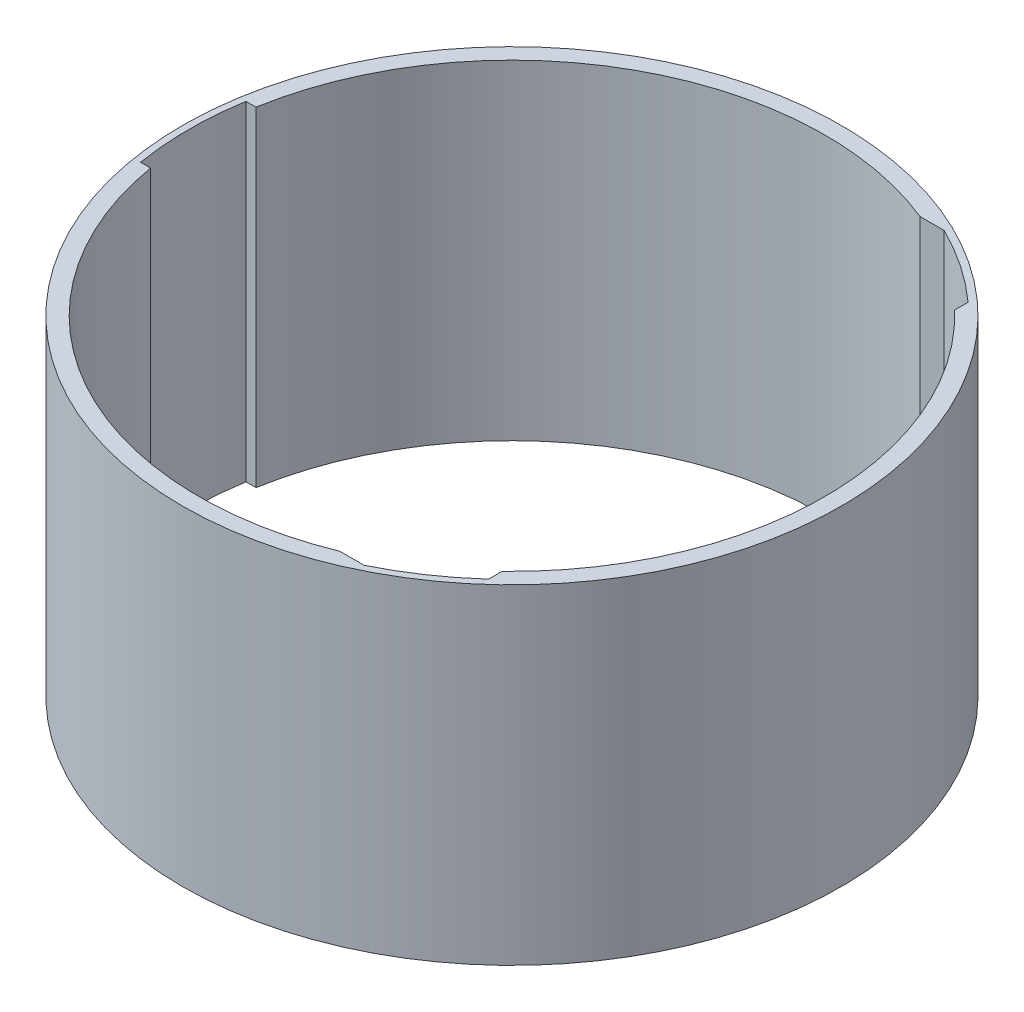
ISO-10303-21;
HEADER;
FILE_DESCRIPTION(('STEP AP214'),'2;1');
FILE_NAME('part.step','',(''),(''),'','','');
FILE_SCHEMA(('AUTOMOTIVE_DESIGN { 1 0 10303 214 1 1 1 1 }'));
ENDSEC;
DATA;
#1=APPLICATION_CONTEXT('core data for automotive mechanical design processes');
#2=APPLICATION_PROTOCOL_DEFINITION('international standard','automotive_design',2000,#1);
#3=PRODUCT_CONTEXT('',#1,'mechanical');
#4=PRODUCT('Part','Part','',(#3));
#5=PRODUCT_RELATED_PRODUCT_CATEGORY('part','',(#4));
#6=PRODUCT_DEFINITION_FORMATION('','',#4);
#7=PRODUCT_DEFINITION_CONTEXT('part definition',#1,'design');
#8=PRODUCT_DEFINITION('design','',#6,#7);
#9=PRODUCT_DEFINITION_SHAPE('','',#8);
#10=(LENGTH_UNIT() NAMED_UNIT(*) SI_UNIT(.MILLI.,.METRE.));
#11=(NAMED_UNIT(*) PLANE_ANGLE_UNIT() SI_UNIT($,.RADIAN.));
#12=(NAMED_UNIT(*) SI_UNIT($,.STERADIAN.) SOLID_ANGLE_UNIT());
#13=UNCERTAINTY_MEASURE_WITH_UNIT(LENGTH_MEASURE(1.E-05),#10,'distance_accuracy_value','');
#14=(GEOMETRIC_REPRESENTATION_CONTEXT(3) GLOBAL_UNCERTAINTY_ASSIGNED_CONTEXT((#13)) GLOBAL_UNIT_ASSIGNED_CONTEXT((#10,
#11,#12)) REPRESENTATION_CONTEXT('',''));
#15=CARTESIAN_POINT('',(0.,0.,0.));
#16=DIRECTION('',(0.,0.,1.));
#17=DIRECTION('',(1.,0.,0.));
#18=AXIS2_PLACEMENT_3D('',#15,#16,#17);
#19=CARTESIAN_POINT('',(0.,100.,0.));
#20=DIRECTION('',(0.,1.,0.));
#21=DIRECTION('',(0.,0.,1.));
#22=AXIS2_PLACEMENT_3D('',#19,#20,#21);
#23=PLANE('',#22);
#24=DIRECTION('',(0.,0.,-1.00000000000002));
#25=VECTOR('',#24,1.);
#26=CARTESIAN_POINT('',(65.656830535391,100.,0.));
#27=LINE('',#26,#25);
#28=CARTESIAN_POINT('',(65.6568305353912,100.,-68.6598907954808));
#29=VERTEX_POINT('',#28);
#30=CARTESIAN_POINT('',(65.6568305353908,100.,-72.7542480137574));
#31=VERTEX_POINT('',#30);
#32=EDGE_CURVE('E134',#29,#31,#27,.T.);
#33=ORIENTED_EDGE('',*,*,#32,.F.);
#34=CARTESIAN_POINT('',(0.,100.,0.));
#35=DIRECTION('',(0.,1.,0.));
#36=DIRECTION('',(0.,0.,1.));
#37=AXIS2_PLACEMENT_3D('',#34,#35,#36);
#38=CIRCLE('',#37,95.);
#39=CARTESIAN_POINT('',(65.6568305353945,100.,68.6598907954745));
#40=VERTEX_POINT('',#39);
#41=EDGE_CURVE('E219',#40,#29,#38,.T.);
#42=ORIENTED_EDGE('',*,*,#41,.F.);
#43=DIRECTION('',(0.,0.,1.00000000000004));
#44=VECTOR('',#43,1.);
#45=CARTESIAN_POINT('',(65.6568305353921,100.,0.));
#46=LINE('',#45,#44);
#47=CARTESIAN_POINT('',(65.6568305353932,100.,72.7542480137596));
#48=VERTEX_POINT('',#47);
#49=EDGE_CURVE('E171',#40,#48,#46,.T.);
#50=ORIENTED_EDGE('',*,*,#49,.T.);
#51=CARTESIAN_POINT('',(0.,100.,0.));
#52=DIRECTION('',(0.,1.,0.));
#53=DIRECTION('',(0.,0.,1.00000000000004));
#54=AXIS2_PLACEMENT_3D('',#51,#52,#53);
#55=CIRCLE('',#54,98.);
#56=CARTESIAN_POINT('',(43.1540945167013,100.,87.9870679500372));
#57=VERTEX_POINT('',#56);
#58=EDGE_CURVE('E180',#57,#48,#55,.T.);
#59=ORIENTED_EDGE('',*,*,#58,.F.);
#60=DIRECTION('',(-1.00000000000004,0.,0.));
#61=VECTOR('',#60,1.);
#62=CARTESIAN_POINT('',(0.,100.,87.987067950037));
#63=LINE('',#62,#61);
#64=CARTESIAN_POINT('',(35.822840110135,100.,87.9870679500373));
#65=VERTEX_POINT('',#64);
#66=EDGE_CURVE('E177',#57,#65,#63,.T.);
#67=ORIENTED_EDGE('',*,*,#66,.T.);
#68=CARTESIAN_POINT('',(-93.6429388688757,100.,16.0000000000002));
#69=VERTEX_POINT('',#68);
#70=EDGE_CURVE('E215',#69,#65,#38,.T.);
#71=ORIENTED_EDGE('',*,*,#70,.F.);
#72=DIRECTION('',(1.,0.,0.));
#73=VECTOR('',#72,1.);
#74=CARTESIAN_POINT('',(0.,100.,16.0000000000001));
#75=LINE('',#74,#73);
#76=CARTESIAN_POINT('',(-96.6850557221749,100.,16.0000000000001));
#77=VERTEX_POINT('',#76);
#78=EDGE_CURVE('E54',#77,#69,#75,.T.);
#79=ORIENTED_EDGE('',*,*,#78,.F.);
#80=CARTESIAN_POINT('',(0.,100.,0.));
#81=DIRECTION('',(0.,1.,0.));
#82=DIRECTION('',(0.,0.,1.));
#83=AXIS2_PLACEMENT_3D('',#80,#81,#82);
#84=CIRCLE('',#83,98.);
#85=CARTESIAN_POINT('',(-96.6850557221749,100.,-16.));
#86=VERTEX_POINT('',#85);
#87=EDGE_CURVE('E205',#86,#77,#84,.T.);
#88=ORIENTED_EDGE('',*,*,#87,.F.);
#89=DIRECTION('',(1.,0.,0.));
#90=VECTOR('',#89,1.);
#91=CARTESIAN_POINT('',(0.,100.,-16.0000000000001));
#92=LINE('',#91,#90);
#93=CARTESIAN_POINT('',(-93.6429388688762,100.,-16.));
#94=VERTEX_POINT('',#93);
#95=EDGE_CURVE('E202',#86,#94,#92,.T.);
#96=ORIENTED_EDGE('',*,*,#95,.T.);
#97=CARTESIAN_POINT('',(35.8228401101249,100.,-87.987067950037));
#98=VERTEX_POINT('',#97);
#99=EDGE_CURVE('E218',#98,#94,#38,.T.);
#100=ORIENTED_EDGE('',*,*,#99,.F.);
#101=DIRECTION('',(-1.00000000000002,0.,0.));
#102=VECTOR('',#101,1.);
#103=CARTESIAN_POINT('',(0.,100.,-87.9870679500354));
#104=LINE('',#103,#102);
#105=CARTESIAN_POINT('',(43.1540945166999,100.,-87.9870679500354));
#106=VERTEX_POINT('',#105);
#107=EDGE_CURVE('E62',#106,#98,#104,.T.);
#108=ORIENTED_EDGE('',*,*,#107,.F.);
#109=CARTESIAN_POINT('',(0.,100.,0.));
#110=DIRECTION('',(0.,1.,0.));
#111=DIRECTION('',(0.,0.,1.00000000000002));
#112=AXIS2_PLACEMENT_3D('',#109,#110,#111);
#113=CIRCLE('',#112,98.);
#114=EDGE_CURVE('E155',#31,#106,#113,.T.);
#115=ORIENTED_EDGE('',*,*,#114,.F.);
#116=EDGE_LOOP('',(#33,#42,#50,#59,#67,#71,#79,#88,#96,#100,#108,#115));
#117=FACE_BOUND('',#116,.T.);
#118=CARTESIAN_POINT('',(0.,100.,0.));
#119=DIRECTION('',(0.,1.,0.));
#120=DIRECTION('',(0.,0.,1.));
#121=AXIS2_PLACEMENT_3D('',#118,#119,#120);
#122=CIRCLE('',#121,100.);
#123=CARTESIAN_POINT('',(0.,100.,100.));
#124=VERTEX_POINT('',#123);
#125=EDGE_CURVE('E11',#124,#124,#122,.T.);
#126=ORIENTED_EDGE('',*,*,#125,.T.);
#127=EDGE_LOOP('',(#126));
#128=FACE_BOUND('',#127,.T.);
#129=ADVANCED_FACE('F39',(#117,#128),#23,.T.);
#130=CARTESIAN_POINT('',(0.,0.,0.));
#131=DIRECTION('',(0.,1.,0.));
#132=DIRECTION('',(0.,0.,1.));
#133=AXIS2_PLACEMENT_3D('',#130,#131,#132);
#134=PLANE('',#133);
#135=CARTESIAN_POINT('',(0.,0.,0.));
#136=DIRECTION('',(0.,1.,0.));
#137=DIRECTION('',(0.,0.,1.));
#138=AXIS2_PLACEMENT_3D('',#135,#136,#137);
#139=CIRCLE('',#138,95.);
#140=CARTESIAN_POINT('',(65.6568305353929,0.,68.6598907954818));
#141=VERTEX_POINT('',#140);
#142=CARTESIAN_POINT('',(65.6568305353912,0.,-68.6598907954808));
#143=VERTEX_POINT('',#142);
#144=EDGE_CURVE('E153',#141,#143,#139,.T.);
#145=ORIENTED_EDGE('',*,*,#144,.T.);
#146=DIRECTION('',(0.,0.,-1.00000000000002));
#147=VECTOR('',#146,1.);
#148=CARTESIAN_POINT('',(65.656830535391,0.,0.));
#149=LINE('',#148,#147);
#150=CARTESIAN_POINT('',(65.6568305353908,0.,-72.7542480137574));
#151=VERTEX_POINT('',#150);
#152=EDGE_CURVE('E131',#143,#151,#149,.T.);
#153=ORIENTED_EDGE('',*,*,#152,.T.);
#154=CARTESIAN_POINT('',(0.,0.,0.));
#155=DIRECTION('',(0.,1.,0.));
#156=DIRECTION('',(0.,0.,1.00000000000002));
#157=AXIS2_PLACEMENT_3D('',#154,#155,#156);
#158=CIRCLE('',#157,98.);
#159=CARTESIAN_POINT('',(43.1540945166999,0.,-87.9870679500354));
#160=VERTEX_POINT('',#159);
#161=EDGE_CURVE('E142',#151,#160,#158,.T.);
#162=ORIENTED_EDGE('',*,*,#161,.T.);
#163=DIRECTION('',(-1.00000000000002,0.,0.));
#164=VECTOR('',#163,1.);
#165=CARTESIAN_POINT('',(0.,0.,-87.9870679500354));
#166=LINE('',#165,#164);
#167=CARTESIAN_POINT('',(35.8228401101346,0.,-87.9870679500354));
#168=VERTEX_POINT('',#167);
#169=EDGE_CURVE('E139',#160,#168,#166,.T.);
#170=ORIENTED_EDGE('',*,*,#169,.T.);
#171=CARTESIAN_POINT('',(-93.6429388688762,0.,-16.));
#172=VERTEX_POINT('',#171);
#173=EDGE_CURVE('E221',#168,#172,#139,.T.);
#174=ORIENTED_EDGE('',*,*,#173,.T.);
#175=DIRECTION('',(1.,0.,0.));
#176=VECTOR('',#175,1.);
#177=CARTESIAN_POINT('',(0.,0.,-16.0000000000001));
#178=LINE('',#177,#176);
#179=CARTESIAN_POINT('',(-96.6850557221749,0.,-16.));
#180=VERTEX_POINT('',#179);
#181=EDGE_CURVE('E193',#180,#172,#178,.T.);
#182=ORIENTED_EDGE('',*,*,#181,.F.);
#183=CARTESIAN_POINT('',(0.,0.,0.));
#184=DIRECTION('',(0.,1.,0.));
#185=DIRECTION('',(0.,0.,1.));
#186=AXIS2_PLACEMENT_3D('',#183,#184,#185);
#187=CIRCLE('',#186,98.);
#188=CARTESIAN_POINT('',(-96.6850557221749,0.,16.0000000000001));
#189=VERTEX_POINT('',#188);
#190=EDGE_CURVE('E195',#180,#189,#187,.T.);
#191=ORIENTED_EDGE('',*,*,#190,.T.);
#192=DIRECTION('',(1.,0.,0.));
#193=VECTOR('',#192,1.);
#194=CARTESIAN_POINT('',(0.,0.,16.0000000000001));
#195=LINE('',#194,#193);
#196=CARTESIAN_POINT('',(-93.6429388688763,0.,16.0000000000001));
#197=VERTEX_POINT('',#196);
#198=EDGE_CURVE('E198',#189,#197,#195,.T.);
#199=ORIENTED_EDGE('',*,*,#198,.T.);
#200=CARTESIAN_POINT('',(35.822840110135,0.,87.9870679500373));
#201=VERTEX_POINT('',#200);
#202=EDGE_CURVE('E164',#197,#201,#139,.T.);
#203=ORIENTED_EDGE('',*,*,#202,.T.);
#204=DIRECTION('',(-1.00000000000004,0.,0.));
#205=VECTOR('',#204,1.);
#206=CARTESIAN_POINT('',(0.,0.,87.987067950037));
#207=LINE('',#206,#205);
#208=CARTESIAN_POINT('',(43.1540945167013,0.,87.9870679500372));
#209=VERTEX_POINT('',#208);
#210=EDGE_CURVE('E168',#209,#201,#207,.T.);
#211=ORIENTED_EDGE('',*,*,#210,.F.);
#212=CARTESIAN_POINT('',(0.,0.,0.));
#213=DIRECTION('',(0.,1.,0.));
#214=DIRECTION('',(0.,0.,1.00000000000004));
#215=AXIS2_PLACEMENT_3D('',#212,#213,#214);
#216=CIRCLE('',#215,98.);
#217=CARTESIAN_POINT('',(65.6568305353932,0.,72.7542480137596));
#218=VERTEX_POINT('',#217);
#219=EDGE_CURVE('E170',#209,#218,#216,.T.);
#220=ORIENTED_EDGE('',*,*,#219,.T.);
#221=DIRECTION('',(0.,0.,1.00000000000004));
#222=VECTOR('',#221,1.);
#223=CARTESIAN_POINT('',(65.6568305353921,0.,0.));
#224=LINE('',#223,#222);
#225=EDGE_CURVE('E174',#141,#218,#224,.T.);
#226=ORIENTED_EDGE('',*,*,#225,.F.);
#227=EDGE_LOOP('',(#145,#153,#162,#170,#174,#182,#191,#199,#203,#211,#220,#226));
#228=FACE_BOUND('',#227,.T.);
#229=CARTESIAN_POINT('',(0.,0.,0.));
#230=DIRECTION('',(0.,1.,0.));
#231=DIRECTION('',(0.,0.,1.));
#232=AXIS2_PLACEMENT_3D('',#229,#230,#231);
#233=CIRCLE('',#232,100.);
#234=CARTESIAN_POINT('',(0.,0.,100.));
#235=VERTEX_POINT('',#234);
#236=EDGE_CURVE('E43',#235,#235,#233,.T.);
#237=ORIENTED_EDGE('',*,*,#236,.F.);
#238=EDGE_LOOP('',(#237));
#239=FACE_BOUND('',#238,.T.);
#240=ADVANCED_FACE('F149',(#228,#239),#134,.F.);
#241=CARTESIAN_POINT('',(0.,100.,0.));
#242=DIRECTION('',(0.,-1.,0.));
#243=DIRECTION('',(0.,0.,-1.));
#244=AXIS2_PLACEMENT_3D('',#241,#242,#243);
#245=CYLINDRICAL_SURFACE('',#244,95.);
#246=DIRECTION('',(0.,1.,0.));
#247=VECTOR('',#246,1.);
#248=CARTESIAN_POINT('',(65.6568305353912,0.,-68.6598907954808));
#249=LINE('',#248,#247);
#250=EDGE_CURVE('E162',#143,#29,#249,.T.);
#251=ORIENTED_EDGE('',*,*,#250,.F.);
#252=ORIENTED_EDGE('',*,*,#144,.F.);
#253=DIRECTION('',(0.,1.,0.));
#254=VECTOR('',#253,1.);
#255=CARTESIAN_POINT('',(65.6568305353929,0.,68.6598907954818));
#256=LINE('',#255,#254);
#257=EDGE_CURVE('E187',#141,#40,#256,.T.);
#258=ORIENTED_EDGE('',*,*,#257,.T.);
#259=ORIENTED_EDGE('',*,*,#41,.T.);
#260=EDGE_LOOP('',(#251,#252,#258,#259));
#261=FACE_BOUND('',#260,.T.);
#262=ADVANCED_FACE('F257',(#261),#245,.F.);
#263=ORIENTED_EDGE('',*,*,#70,.T.);
#264=DIRECTION('',(0.,1.,0.));
#265=VECTOR('',#264,1.);
#266=CARTESIAN_POINT('',(35.822840110135,0.,87.9870679500373));
#267=LINE('',#266,#265);
#268=EDGE_CURVE('E160',#201,#65,#267,.T.);
#269=ORIENTED_EDGE('',*,*,#268,.F.);
#270=ORIENTED_EDGE('',*,*,#202,.F.);
#271=DIRECTION('',(0.,1.,0.));
#272=VECTOR('',#271,1.);
#273=CARTESIAN_POINT('',(-93.6429388688763,0.,16.0000000000001));
#274=LINE('',#273,#272);
#275=EDGE_CURVE('E210',#197,#69,#274,.T.);
#276=ORIENTED_EDGE('',*,*,#275,.T.);
#277=EDGE_LOOP('',(#263,#269,#270,#276));
#278=FACE_BOUND('',#277,.T.);
#279=ADVANCED_FACE('F245',(#278),#245,.F.);
#280=DIRECTION('',(0.,1.,0.));
#281=VECTOR('',#280,1.);
#282=CARTESIAN_POINT('',(35.8228401101346,0.,-87.9870679500354));
#283=LINE('',#282,#281);
#284=EDGE_CURVE('E165',#168,#98,#283,.T.);
#285=ORIENTED_EDGE('',*,*,#284,.T.);
#286=ORIENTED_EDGE('',*,*,#99,.T.);
#287=DIRECTION('',(0.,1.,0.));
#288=VECTOR('',#287,1.);
#289=CARTESIAN_POINT('',(-93.6429388688762,0.,-16.));
#290=LINE('',#289,#288);
#291=EDGE_CURVE('E181',#172,#94,#290,.T.);
#292=ORIENTED_EDGE('',*,*,#291,.F.);
#293=ORIENTED_EDGE('',*,*,#173,.F.);
#294=EDGE_LOOP('',(#285,#286,#292,#293));
#295=FACE_BOUND('',#294,.T.);
#296=ADVANCED_FACE('F229',(#295),#245,.F.);
#297=CARTESIAN_POINT('',(0.,100.,0.));
#298=DIRECTION('',(0.,-1.,0.));
#299=DIRECTION('',(0.,0.,-1.));
#300=AXIS2_PLACEMENT_3D('',#297,#298,#299);
#301=CYLINDRICAL_SURFACE('',#300,100.);
#302=ORIENTED_EDGE('',*,*,#125,.F.);
#303=EDGE_LOOP('',(#302));
#304=FACE_BOUND('',#303,.T.);
#305=ORIENTED_EDGE('',*,*,#236,.T.);
#306=EDGE_LOOP('',(#305));
#307=FACE_BOUND('',#306,.T.);
#308=ADVANCED_FACE('F41',(#304,#307),#301,.T.);
#309=CARTESIAN_POINT('',(0.,0.,-16.0000000000001));
#310=DIRECTION('',(0.,0.,1.));
#311=DIRECTION('',(1.,0.,0.));
#312=AXIS2_PLACEMENT_3D('',#309,#310,#311);
#313=PLANE('',#312);
#314=ORIENTED_EDGE('',*,*,#95,.F.);
#315=DIRECTION('',(0.,1.,0.));
#316=VECTOR('',#315,1.);
#317=CARTESIAN_POINT('',(-96.6850557221749,0.,-16.));
#318=LINE('',#317,#316);
#319=EDGE_CURVE('E201',#180,#86,#318,.T.);
#320=ORIENTED_EDGE('',*,*,#319,.F.);
#321=ORIENTED_EDGE('',*,*,#181,.T.);
#322=ORIENTED_EDGE('',*,*,#291,.T.);
#323=EDGE_LOOP('',(#314,#320,#321,#322));
#324=FACE_BOUND('',#323,.T.);
#325=ADVANCED_FACE('F234',(#324),#313,.T.);
#326=CARTESIAN_POINT('',(0.,0.,16.0000000000001));
#327=DIRECTION('',(0.,0.,1.));
#328=DIRECTION('',(1.,0.,0.));
#329=AXIS2_PLACEMENT_3D('',#326,#327,#328);
#330=PLANE('',#329);
#331=ORIENTED_EDGE('',*,*,#78,.T.);
#332=ORIENTED_EDGE('',*,*,#275,.F.);
#333=ORIENTED_EDGE('',*,*,#198,.F.);
#334=DIRECTION('',(0.,1.,0.));
#335=VECTOR('',#334,1.);
#336=CARTESIAN_POINT('',(-96.6850557221749,0.,16.0000000000001));
#337=LINE('',#336,#335);
#338=EDGE_CURVE('E212',#189,#77,#337,.T.);
#339=ORIENTED_EDGE('',*,*,#338,.T.);
#340=EDGE_LOOP('',(#331,#332,#333,#339));
#341=FACE_BOUND('',#340,.T.);
#342=ADVANCED_FACE('F272',(#341),#330,.F.);
#343=CARTESIAN_POINT('',(0.,0.,0.));
#344=DIRECTION('',(0.,1.,0.));
#345=DIRECTION('',(0.,0.,1.));
#346=AXIS2_PLACEMENT_3D('',#343,#344,#345);
#347=CYLINDRICAL_SURFACE('',#346,98.);
#348=ORIENTED_EDGE('',*,*,#87,.T.);
#349=ORIENTED_EDGE('',*,*,#338,.F.);
#350=ORIENTED_EDGE('',*,*,#190,.F.);
#351=ORIENTED_EDGE('',*,*,#319,.T.);
#352=EDGE_LOOP('',(#348,#349,#350,#351));
#353=FACE_BOUND('',#352,.T.);
#354=ADVANCED_FACE('F240',(#353),#347,.F.);
#355=CARTESIAN_POINT('',(0.,0.,87.987067950037));
#356=DIRECTION('',(0.,0.,-1.));
#357=DIRECTION('',(-1.,0.,0.));
#358=AXIS2_PLACEMENT_3D('',#355,#356,#357);
#359=PLANE('',#358);
#360=ORIENTED_EDGE('',*,*,#66,.F.);
#361=DIRECTION('',(0.,1.,0.));
#362=VECTOR('',#361,1.);
#363=CARTESIAN_POINT('',(43.1540945167013,0.,87.9870679500372));
#364=LINE('',#363,#362);
#365=EDGE_CURVE('E176',#209,#57,#364,.T.);
#366=ORIENTED_EDGE('',*,*,#365,.F.);
#367=ORIENTED_EDGE('',*,*,#210,.T.);
#368=ORIENTED_EDGE('',*,*,#268,.T.);
#369=EDGE_LOOP('',(#360,#366,#367,#368));
#370=FACE_BOUND('',#369,.T.);
#371=ADVANCED_FACE('F248',(#370),#359,.T.);
#372=CARTESIAN_POINT('',(65.6568305353921,0.,0.));
#373=DIRECTION('',(-1.,0.,0.));
#374=DIRECTION('',(0.,0.,1.));
#375=AXIS2_PLACEMENT_3D('',#372,#373,#374);
#376=PLANE('',#375);
#377=ORIENTED_EDGE('',*,*,#49,.F.);
#378=ORIENTED_EDGE('',*,*,#257,.F.);
#379=ORIENTED_EDGE('',*,*,#225,.T.);
#380=DIRECTION('',(0.,1.,0.));
#381=VECTOR('',#380,1.);
#382=CARTESIAN_POINT('',(65.6568305353932,0.,72.7542480137596));
#383=LINE('',#382,#381);
#384=EDGE_CURVE('E190',#218,#48,#383,.T.);
#385=ORIENTED_EDGE('',*,*,#384,.T.);
#386=EDGE_LOOP('',(#377,#378,#379,#385));
#387=FACE_BOUND('',#386,.T.);
#388=ADVANCED_FACE('F279',(#387),#376,.T.);
#389=CARTESIAN_POINT('',(0.,0.,0.));
#390=DIRECTION('',(0.,1.,0.));
#391=DIRECTION('',(0.,0.,1.));
#392=AXIS2_PLACEMENT_3D('',#389,#390,#391);
#393=CYLINDRICAL_SURFACE('',#392,98.);
#394=ORIENTED_EDGE('',*,*,#58,.T.);
#395=ORIENTED_EDGE('',*,*,#384,.F.);
#396=ORIENTED_EDGE('',*,*,#219,.F.);
#397=ORIENTED_EDGE('',*,*,#365,.T.);
#398=EDGE_LOOP('',(#394,#395,#396,#397));
#399=FACE_BOUND('',#398,.T.);
#400=ADVANCED_FACE('F253',(#399),#393,.F.);
#401=CARTESIAN_POINT('',(65.656830535391,0.,0.));
#402=DIRECTION('',(1.,0.,0.));
#403=DIRECTION('',(0.,0.,-1.));
#404=AXIS2_PLACEMENT_3D('',#401,#402,#403);
#405=PLANE('',#404);
#406=ORIENTED_EDGE('',*,*,#32,.T.);
#407=DIRECTION('',(0.,1.,0.));
#408=VECTOR('',#407,1.);
#409=CARTESIAN_POINT('',(65.6568305353908,0.,-72.7542480137574));
#410=LINE('',#409,#408);
#411=EDGE_CURVE('E127',#151,#31,#410,.T.);
#412=ORIENTED_EDGE('',*,*,#411,.F.);
#413=ORIENTED_EDGE('',*,*,#152,.F.);
#414=ORIENTED_EDGE('',*,*,#250,.T.);
#415=EDGE_LOOP('',(#406,#412,#413,#414));
#416=FACE_BOUND('',#415,.T.);
#417=ADVANCED_FACE('F129',(#416),#405,.F.);
#418=CARTESIAN_POINT('',(0.,0.,-87.9870679500354));
#419=DIRECTION('',(0.,0.,-1.));
#420=DIRECTION('',(-1.,0.,0.));
#421=AXIS2_PLACEMENT_3D('',#418,#419,#420);
#422=PLANE('',#421);
#423=ORIENTED_EDGE('',*,*,#107,.T.);
#424=ORIENTED_EDGE('',*,*,#284,.F.);
#425=ORIENTED_EDGE('',*,*,#169,.F.);
#426=DIRECTION('',(0.,1.,0.));
#427=VECTOR('',#426,1.);
#428=CARTESIAN_POINT('',(43.1540945166999,0.,-87.9870679500354));
#429=LINE('',#428,#427);
#430=EDGE_CURVE('E138',#160,#106,#429,.T.);
#431=ORIENTED_EDGE('',*,*,#430,.T.);
#432=EDGE_LOOP('',(#423,#424,#425,#431));
#433=FACE_BOUND('',#432,.T.);
#434=ADVANCED_FACE('F286',(#433),#422,.F.);
#435=CARTESIAN_POINT('',(0.,0.,0.));
#436=DIRECTION('',(0.,1.,0.));
#437=DIRECTION('',(0.,0.,1.));
#438=AXIS2_PLACEMENT_3D('',#435,#436,#437);
#439=CYLINDRICAL_SURFACE('',#438,98.);
#440=ORIENTED_EDGE('',*,*,#114,.T.);
#441=ORIENTED_EDGE('',*,*,#430,.F.);
#442=ORIENTED_EDGE('',*,*,#161,.F.);
#443=ORIENTED_EDGE('',*,*,#411,.T.);
#444=EDGE_LOOP('',(#440,#441,#442,#443));
#445=FACE_BOUND('',#444,.T.);
#446=ADVANCED_FACE('F143',(#445),#439,.F.);
#447=CLOSED_SHELL('',(#129,#240,#262,#279,#296,#308,#325,#342,#354,#371,#388,#400,#417,#434,#446));
#448=MANIFOLD_SOLID_BREP('B2',#447);
#449=ADVANCED_BREP_SHAPE_REPRESENTATION('',(#18,#448),#14);
#450=SHAPE_DEFINITION_REPRESENTATION(#9,#449);
ENDSEC;
END-ISO-10303-21;
